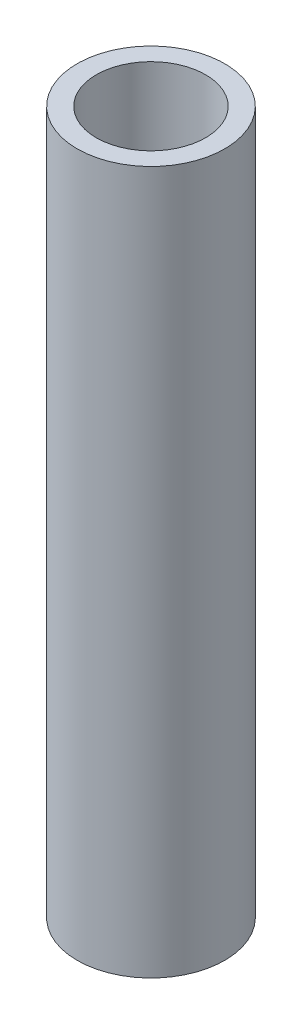
ISO-10303-21;
HEADER;
FILE_DESCRIPTION(('STEP AP214'),'2;1');
FILE_NAME('part.step','',(''),(''),'','','');
FILE_SCHEMA(('AUTOMOTIVE_DESIGN { 1 0 10303 214 1 1 1 1 }'));
ENDSEC;
DATA;
#1=APPLICATION_CONTEXT('core data for automotive mechanical design processes');
#2=APPLICATION_PROTOCOL_DEFINITION('international standard','automotive_design',2000,#1);
#3=PRODUCT_CONTEXT('',#1,'mechanical');
#4=PRODUCT('Part','Part','',(#3));
#5=PRODUCT_RELATED_PRODUCT_CATEGORY('part','',(#4));
#6=PRODUCT_DEFINITION_FORMATION('','',#4);
#7=PRODUCT_DEFINITION_CONTEXT('part definition',#1,'design');
#8=PRODUCT_DEFINITION('design','',#6,#7);
#9=PRODUCT_DEFINITION_SHAPE('','',#8);
#10=(LENGTH_UNIT() NAMED_UNIT(*) SI_UNIT(.MILLI.,.METRE.));
#11=(NAMED_UNIT(*) PLANE_ANGLE_UNIT() SI_UNIT($,.RADIAN.));
#12=(NAMED_UNIT(*) SI_UNIT($,.STERADIAN.) SOLID_ANGLE_UNIT());
#13=UNCERTAINTY_MEASURE_WITH_UNIT(LENGTH_MEASURE(1.E-05),#10,'distance_accuracy_value','');
#14=(GEOMETRIC_REPRESENTATION_CONTEXT(3) GLOBAL_UNCERTAINTY_ASSIGNED_CONTEXT((#13)) GLOBAL_UNIT_ASSIGNED_CONTEXT((#10,
#11,#12)) REPRESENTATION_CONTEXT('',''));
#15=CARTESIAN_POINT('',(0.,0.,0.));
#16=DIRECTION('',(0.,0.,1.));
#17=DIRECTION('',(1.,0.,0.));
#18=AXIS2_PLACEMENT_3D('',#15,#16,#17);
#19=CARTESIAN_POINT('',(0.,101.6,0.));
#20=DIRECTION('',(0.,1.,0.));
#21=DIRECTION('',(0.,0.,1.));
#22=AXIS2_PLACEMENT_3D('',#19,#20,#21);
#23=PLANE('',#22);
#24=CARTESIAN_POINT('',(0.,101.6,0.));
#25=DIRECTION('',(0.,1.,0.));
#26=DIRECTION('',(0.,0.,1.));
#27=AXIS2_PLACEMENT_3D('',#24,#25,#26);
#28=CIRCLE('',#27,10.668);
#29=CARTESIAN_POINT('',(0.,101.6,10.668));
#30=VERTEX_POINT('',#29);
#31=EDGE_CURVE('E10',#30,#30,#28,.T.);
#32=ORIENTED_EDGE('',*,*,#31,.T.);
#33=EDGE_LOOP('',(#32));
#34=FACE_BOUND('',#33,.T.);
#35=CARTESIAN_POINT('',(0.,101.6,0.));
#36=DIRECTION('',(0.,1.,0.));
#37=DIRECTION('',(0.,0.,1.));
#38=AXIS2_PLACEMENT_3D('',#35,#36,#37);
#39=CIRCLE('',#38,7.8994);
#40=CARTESIAN_POINT('',(0.,101.6,7.8994));
#41=VERTEX_POINT('',#40);
#42=EDGE_CURVE('E44',#41,#41,#39,.T.);
#43=ORIENTED_EDGE('',*,*,#42,.F.);
#44=EDGE_LOOP('',(#43));
#45=FACE_BOUND('',#44,.T.);
#46=ADVANCED_FACE('F33',(#34,#45),#23,.T.);
#47=CARTESIAN_POINT('',(0.,0.,0.));
#48=DIRECTION('',(0.,1.,0.));
#49=DIRECTION('',(0.,0.,1.));
#50=AXIS2_PLACEMENT_3D('',#47,#48,#49);
#51=PLANE('',#50);
#52=CARTESIAN_POINT('',(0.,0.,0.));
#53=DIRECTION('',(0.,1.,0.));
#54=DIRECTION('',(0.,0.,1.));
#55=AXIS2_PLACEMENT_3D('',#52,#53,#54);
#56=CIRCLE('',#55,10.668);
#57=CARTESIAN_POINT('',(0.,0.,10.668));
#58=VERTEX_POINT('',#57);
#59=EDGE_CURVE('E37',#58,#58,#56,.T.);
#60=ORIENTED_EDGE('',*,*,#59,.F.);
#61=EDGE_LOOP('',(#60));
#62=FACE_BOUND('',#61,.T.);
#63=CARTESIAN_POINT('',(0.,0.,0.));
#64=DIRECTION('',(0.,1.,0.));
#65=DIRECTION('',(0.,0.,1.));
#66=AXIS2_PLACEMENT_3D('',#63,#64,#65);
#67=CIRCLE('',#66,7.8994);
#68=CARTESIAN_POINT('',(0.,0.,7.8994));
#69=VERTEX_POINT('',#68);
#70=EDGE_CURVE('E46',#69,#69,#67,.T.);
#71=ORIENTED_EDGE('',*,*,#70,.T.);
#72=EDGE_LOOP('',(#71));
#73=FACE_BOUND('',#72,.T.);
#74=ADVANCED_FACE('F56',(#62,#73),#51,.F.);
#75=CARTESIAN_POINT('',(0.,101.6,0.));
#76=DIRECTION('',(0.,-1.,0.));
#77=DIRECTION('',(0.,0.,-1.));
#78=AXIS2_PLACEMENT_3D('',#75,#76,#77);
#79=CYLINDRICAL_SURFACE('',#78,10.668);
#80=ORIENTED_EDGE('',*,*,#31,.F.);
#81=EDGE_LOOP('',(#80));
#82=FACE_BOUND('',#81,.T.);
#83=ORIENTED_EDGE('',*,*,#59,.T.);
#84=EDGE_LOOP('',(#83));
#85=FACE_BOUND('',#84,.T.);
#86=ADVANCED_FACE('F35',(#82,#85),#79,.T.);
#87=CARTESIAN_POINT('',(0.,101.6,0.));
#88=DIRECTION('',(0.,-1.,0.));
#89=DIRECTION('',(0.,0.,-1.));
#90=AXIS2_PLACEMENT_3D('',#87,#88,#89);
#91=CYLINDRICAL_SURFACE('',#90,7.8994);
#92=ORIENTED_EDGE('',*,*,#42,.T.);
#93=EDGE_LOOP('',(#92));
#94=FACE_BOUND('',#93,.T.);
#95=ORIENTED_EDGE('',*,*,#70,.F.);
#96=EDGE_LOOP('',(#95));
#97=FACE_BOUND('',#96,.T.);
#98=ADVANCED_FACE('F52',(#94,#97),#91,.F.);
#99=CLOSED_SHELL('',(#46,#74,#86,#98));
#100=MANIFOLD_SOLID_BREP('B2',#99);
#101=ADVANCED_BREP_SHAPE_REPRESENTATION('',(#18,#100),#14);
#102=SHAPE_DEFINITION_REPRESENTATION(#9,#101);
ENDSEC;
END-ISO-10303-21;
